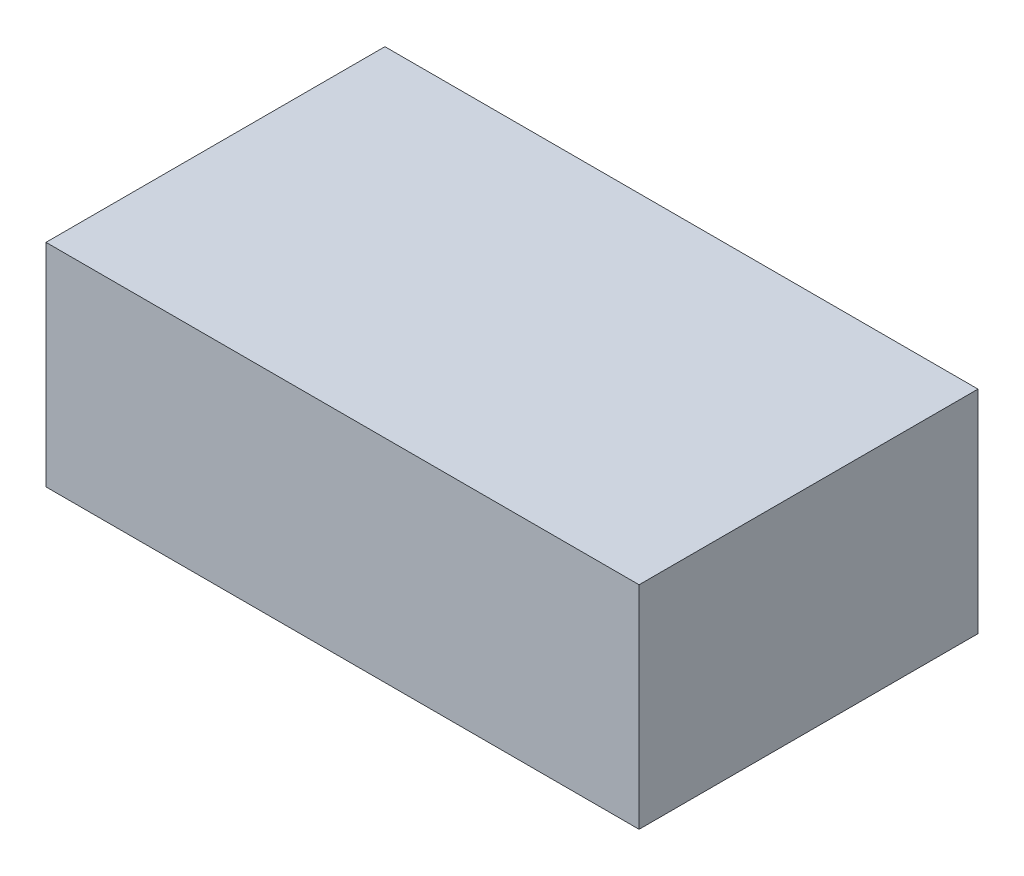
ISO-10303-21;
HEADER;
FILE_DESCRIPTION(('STEP AP214'),'2;1');
FILE_NAME('part.step','',(''),(''),'','','');
FILE_SCHEMA(('AUTOMOTIVE_DESIGN { 1 0 10303 214 1 1 1 1 }'));
ENDSEC;
DATA;
#1=APPLICATION_CONTEXT('core data for automotive mechanical design processes');
#2=APPLICATION_PROTOCOL_DEFINITION('international standard','automotive_design',2000,#1);
#3=PRODUCT_CONTEXT('',#1,'mechanical');
#4=PRODUCT('Part','Part','',(#3));
#5=PRODUCT_RELATED_PRODUCT_CATEGORY('part','',(#4));
#6=PRODUCT_DEFINITION_FORMATION('','',#4);
#7=PRODUCT_DEFINITION_CONTEXT('part definition',#1,'design');
#8=PRODUCT_DEFINITION('design','',#6,#7);
#9=PRODUCT_DEFINITION_SHAPE('','',#8);
#10=(LENGTH_UNIT() NAMED_UNIT(*) SI_UNIT(.MILLI.,.METRE.));
#11=(NAMED_UNIT(*) PLANE_ANGLE_UNIT() SI_UNIT($,.RADIAN.));
#12=(NAMED_UNIT(*) SI_UNIT($,.STERADIAN.) SOLID_ANGLE_UNIT());
#13=UNCERTAINTY_MEASURE_WITH_UNIT(LENGTH_MEASURE(1.E-05),#10,'distance_accuracy_value','');
#14=(GEOMETRIC_REPRESENTATION_CONTEXT(3) GLOBAL_UNCERTAINTY_ASSIGNED_CONTEXT((#13)) GLOBAL_UNIT_ASSIGNED_CONTEXT((#10,
#11,#12)) REPRESENTATION_CONTEXT('',''));
#15=CARTESIAN_POINT('',(0.,0.,0.));
#16=DIRECTION('',(0.,0.,1.));
#17=DIRECTION('',(1.,0.,0.));
#18=AXIS2_PLACEMENT_3D('',#15,#16,#17);
#19=CARTESIAN_POINT('',(-8.89,3.175,10.16));
#20=DIRECTION('',(1.,0.,0.));
#21=DIRECTION('',(0.,0.,-1.));
#22=AXIS2_PLACEMENT_3D('',#19,#20,#21);
#23=PLANE('',#22);
#24=DIRECTION('',(0.,-1.,0.));
#25=VECTOR('',#24,1.);
#26=CARTESIAN_POINT('',(-8.89,3.175,0.));
#27=LINE('',#26,#25);
#28=CARTESIAN_POINT('',(-8.89,3.175,0.));
#29=VERTEX_POINT('',#28);
#30=CARTESIAN_POINT('',(-8.89,-3.175,0.));
#31=VERTEX_POINT('',#30);
#32=EDGE_CURVE('E107',#29,#31,#27,.T.);
#33=ORIENTED_EDGE('',*,*,#32,.T.);
#34=DIRECTION('',(0.,0.,-1.));
#35=VECTOR('',#34,1.);
#36=CARTESIAN_POINT('',(-8.89,-3.175,10.16));
#37=LINE('',#36,#35);
#38=CARTESIAN_POINT('',(-8.89,-3.175,10.16));
#39=VERTEX_POINT('',#38);
#40=EDGE_CURVE('E11',#39,#31,#37,.T.);
#41=ORIENTED_EDGE('',*,*,#40,.F.);
#42=DIRECTION('',(0.,-1.,0.));
#43=VECTOR('',#42,1.);
#44=CARTESIAN_POINT('',(-8.89,3.175,10.16));
#45=LINE('',#44,#43);
#46=CARTESIAN_POINT('',(-8.89,3.175,10.16));
#47=VERTEX_POINT('',#46);
#48=EDGE_CURVE('E91',#47,#39,#45,.T.);
#49=ORIENTED_EDGE('',*,*,#48,.F.);
#50=DIRECTION('',(0.,0.,-1.));
#51=VECTOR('',#50,1.);
#52=CARTESIAN_POINT('',(-8.89,3.175,10.16));
#53=LINE('',#52,#51);
#54=EDGE_CURVE('E103',#47,#29,#53,.T.);
#55=ORIENTED_EDGE('',*,*,#54,.T.);
#56=EDGE_LOOP('',(#33,#41,#49,#55));
#57=FACE_BOUND('',#56,.T.);
#58=ADVANCED_FACE('F39',(#57),#23,.F.);
#59=CARTESIAN_POINT('',(-8.89,-3.175,10.16));
#60=DIRECTION('',(0.,1.,0.));
#61=DIRECTION('',(0.,0.,1.));
#62=AXIS2_PLACEMENT_3D('',#59,#60,#61);
#63=PLANE('',#62);
#64=DIRECTION('',(1.,0.,0.));
#65=VECTOR('',#64,1.);
#66=CARTESIAN_POINT('',(-8.89,-3.175,0.));
#67=LINE('',#66,#65);
#68=CARTESIAN_POINT('',(8.89,-3.175,0.));
#69=VERTEX_POINT('',#68);
#70=EDGE_CURVE('E96',#31,#69,#67,.T.);
#71=ORIENTED_EDGE('',*,*,#70,.T.);
#72=DIRECTION('',(0.,0.,-1.));
#73=VECTOR('',#72,1.);
#74=CARTESIAN_POINT('',(8.89,-3.175,10.16));
#75=LINE('',#74,#73);
#76=CARTESIAN_POINT('',(8.89,-3.175,10.16));
#77=VERTEX_POINT('',#76);
#78=EDGE_CURVE('E48',#77,#69,#75,.T.);
#79=ORIENTED_EDGE('',*,*,#78,.F.);
#80=DIRECTION('',(1.,0.,0.));
#81=VECTOR('',#80,1.);
#82=CARTESIAN_POINT('',(-8.89,-3.175,10.16));
#83=LINE('',#82,#81);
#84=EDGE_CURVE('E86',#39,#77,#83,.T.);
#85=ORIENTED_EDGE('',*,*,#84,.F.);
#86=ORIENTED_EDGE('',*,*,#40,.T.);
#87=EDGE_LOOP('',(#71,#79,#85,#86));
#88=FACE_BOUND('',#87,.T.);
#89=ADVANCED_FACE('F95',(#88),#63,.F.);
#90=CARTESIAN_POINT('',(8.89,3.175,10.16));
#91=DIRECTION('',(-1.,0.,0.));
#92=DIRECTION('',(0.,0.,1.));
#93=AXIS2_PLACEMENT_3D('',#90,#91,#92);
#94=PLANE('',#93);
#95=DIRECTION('',(0.,1.,0.));
#96=VECTOR('',#95,1.);
#97=CARTESIAN_POINT('',(8.89,3.175,0.));
#98=LINE('',#97,#96);
#99=CARTESIAN_POINT('',(8.89,3.175,0.));
#100=VERTEX_POINT('',#99);
#101=EDGE_CURVE('E73',#69,#100,#98,.T.);
#102=ORIENTED_EDGE('',*,*,#101,.T.);
#103=DIRECTION('',(0.,0.,-1.));
#104=VECTOR('',#103,1.);
#105=CARTESIAN_POINT('',(8.89,3.175,10.16));
#106=LINE('',#105,#104);
#107=CARTESIAN_POINT('',(8.89,3.175,10.16));
#108=VERTEX_POINT('',#107);
#109=EDGE_CURVE('E98',#108,#100,#106,.T.);
#110=ORIENTED_EDGE('',*,*,#109,.F.);
#111=DIRECTION('',(0.,1.,0.));
#112=VECTOR('',#111,1.);
#113=CARTESIAN_POINT('',(8.89,3.175,10.16));
#114=LINE('',#113,#112);
#115=EDGE_CURVE('E89',#77,#108,#114,.T.);
#116=ORIENTED_EDGE('',*,*,#115,.F.);
#117=ORIENTED_EDGE('',*,*,#78,.T.);
#118=EDGE_LOOP('',(#102,#110,#116,#117));
#119=FACE_BOUND('',#118,.T.);
#120=ADVANCED_FACE('F99',(#119),#94,.F.);
#121=CARTESIAN_POINT('',(-8.89,3.175,10.16));
#122=DIRECTION('',(0.,-1.,0.));
#123=DIRECTION('',(0.,0.,-1.));
#124=AXIS2_PLACEMENT_3D('',#121,#122,#123);
#125=PLANE('',#124);
#126=DIRECTION('',(-1.,0.,0.));
#127=VECTOR('',#126,1.);
#128=CARTESIAN_POINT('',(-8.89,3.175,0.));
#129=LINE('',#128,#127);
#130=EDGE_CURVE('E79',#100,#29,#129,.T.);
#131=ORIENTED_EDGE('',*,*,#130,.T.);
#132=ORIENTED_EDGE('',*,*,#54,.F.);
#133=DIRECTION('',(-1.,0.,0.));
#134=VECTOR('',#133,1.);
#135=CARTESIAN_POINT('',(-8.89,3.175,10.16));
#136=LINE('',#135,#134);
#137=EDGE_CURVE('E56',#108,#47,#136,.T.);
#138=ORIENTED_EDGE('',*,*,#137,.F.);
#139=ORIENTED_EDGE('',*,*,#109,.T.);
#140=EDGE_LOOP('',(#131,#132,#138,#139));
#141=FACE_BOUND('',#140,.T.);
#142=ADVANCED_FACE('F120',(#141),#125,.F.);
#143=CARTESIAN_POINT('',(0.,0.,10.16));
#144=DIRECTION('',(0.,0.,1.));
#145=DIRECTION('',(1.,0.,0.));
#146=AXIS2_PLACEMENT_3D('',#143,#144,#145);
#147=PLANE('',#146);
#148=ORIENTED_EDGE('',*,*,#48,.T.);
#149=ORIENTED_EDGE('',*,*,#84,.T.);
#150=ORIENTED_EDGE('',*,*,#115,.T.);
#151=ORIENTED_EDGE('',*,*,#137,.T.);
#152=EDGE_LOOP('',(#148,#149,#150,#151));
#153=FACE_BOUND('',#152,.T.);
#154=ADVANCED_FACE('F87',(#153),#147,.T.);
#155=CARTESIAN_POINT('',(0.,0.,0.));
#156=DIRECTION('',(0.,0.,1.));
#157=DIRECTION('',(1.,0.,0.));
#158=AXIS2_PLACEMENT_3D('',#155,#156,#157);
#159=PLANE('',#158);
#160=ORIENTED_EDGE('',*,*,#32,.F.);
#161=ORIENTED_EDGE('',*,*,#130,.F.);
#162=ORIENTED_EDGE('',*,*,#101,.F.);
#163=ORIENTED_EDGE('',*,*,#70,.F.);
#164=EDGE_LOOP('',(#160,#161,#162,#163));
#165=FACE_BOUND('',#164,.T.);
#166=ADVANCED_FACE('F123',(#165),#159,.F.);
#167=CLOSED_SHELL('',(#58,#89,#120,#142,#154,#166));
#168=MANIFOLD_SOLID_BREP('B2',#167);
#169=ADVANCED_BREP_SHAPE_REPRESENTATION('',(#18,#168),#14);
#170=SHAPE_DEFINITION_REPRESENTATION(#9,#169);
ENDSEC;
END-ISO-10303-21;
